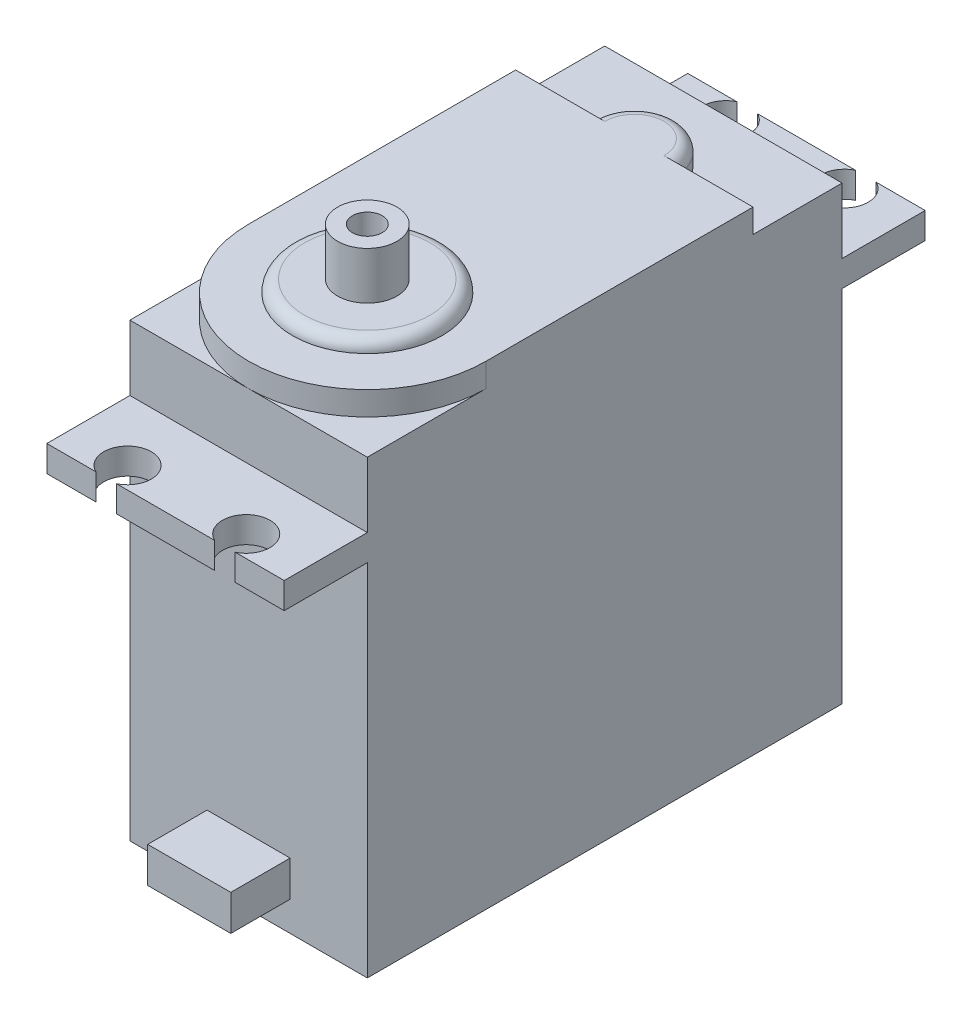
ISO-10303-21;
HEADER;
FILE_DESCRIPTION(('STEP AP214'),'2;1');
FILE_NAME('part.step','',(''),(''),'','','');
FILE_SCHEMA(('AUTOMOTIVE_DESIGN { 1 0 10303 214 1 1 1 1 }'));
ENDSEC;
DATA;
#1=APPLICATION_CONTEXT('core data for automotive mechanical design processes');
#2=APPLICATION_PROTOCOL_DEFINITION('international standard','automotive_design',2000,#1);
#3=PRODUCT_CONTEXT('',#1,'mechanical');
#4=PRODUCT('Part','Part','',(#3));
#5=PRODUCT_RELATED_PRODUCT_CATEGORY('part','',(#4));
#6=PRODUCT_DEFINITION_FORMATION('','',#4);
#7=PRODUCT_DEFINITION_CONTEXT('part definition',#1,'design');
#8=PRODUCT_DEFINITION('design','',#6,#7);
#9=PRODUCT_DEFINITION_SHAPE('','',#8);
#10=(LENGTH_UNIT() NAMED_UNIT(*) SI_UNIT(.MILLI.,.METRE.));
#11=(NAMED_UNIT(*) PLANE_ANGLE_UNIT() SI_UNIT($,.RADIAN.));
#12=(NAMED_UNIT(*) SI_UNIT($,.STERADIAN.) SOLID_ANGLE_UNIT());
#13=UNCERTAINTY_MEASURE_WITH_UNIT(LENGTH_MEASURE(1.E-05),#10,'distance_accuracy_value','');
#14=(GEOMETRIC_REPRESENTATION_CONTEXT(3) GLOBAL_UNCERTAINTY_ASSIGNED_CONTEXT((#13)) GLOBAL_UNIT_ASSIGNED_CONTEXT((#10,
#11,#12)) REPRESENTATION_CONTEXT('',''));
#15=CARTESIAN_POINT('',(0.,0.,0.));
#16=DIRECTION('',(0.,0.,1.));
#17=DIRECTION('',(1.,0.,0.));
#18=AXIS2_PLACEMENT_3D('',#15,#16,#17);
#19=CARTESIAN_POINT('',(0.,38.,0.));
#20=DIRECTION('',(0.,-1.,0.));
#21=DIRECTION('',(0.,0.,-1.));
#22=AXIS2_PLACEMENT_3D('',#19,#20,#21);
#23=PLANE('',#22);
#24=DIRECTION('',(-1.,0.,0.));
#25=VECTOR('',#24,1.);
#26=CARTESIAN_POINT('',(20.,38.,-32.5));
#27=LINE('',#26,#25);
#28=CARTESIAN_POINT('',(20.,38.,-32.5));
#29=VERTEX_POINT('',#28);
#30=CARTESIAN_POINT('',(13.5,38.,-32.5));
#31=VERTEX_POINT('',#30);
#32=EDGE_CURVE('E514',#29,#31,#27,.T.);
#33=ORIENTED_EDGE('',*,*,#32,.F.);
#34=DIRECTION('',(0.,0.,-1.));
#35=VECTOR('',#34,1.);
#36=CARTESIAN_POINT('',(20.,38.,0.));
#37=LINE('',#36,#35);
#38=CARTESIAN_POINT('',(20.,38.,-40.));
#39=VERTEX_POINT('',#38);
#40=EDGE_CURVE('E274',#29,#39,#37,.T.);
#41=ORIENTED_EDGE('',*,*,#40,.T.);
#42=DIRECTION('',(-1.,0.,0.));
#43=VECTOR('',#42,1.);
#44=CARTESIAN_POINT('',(0.,38.,-40.));
#45=LINE('',#44,#43);
#46=CARTESIAN_POINT('',(0.,38.,-40.));
#47=VERTEX_POINT('',#46);
#48=EDGE_CURVE('E445',#39,#47,#45,.T.);
#49=ORIENTED_EDGE('',*,*,#48,.T.);
#50=DIRECTION('',(0.,0.,1.));
#51=VECTOR('',#50,1.);
#52=CARTESIAN_POINT('',(0.,38.,0.));
#53=LINE('',#52,#51);
#54=CARTESIAN_POINT('',(0.,38.,-32.5));
#55=VERTEX_POINT('',#54);
#56=EDGE_CURVE('E433',#47,#55,#53,.T.);
#57=ORIENTED_EDGE('',*,*,#56,.T.);
#58=DIRECTION('',(-1.,0.,0.));
#59=VECTOR('',#58,1.);
#60=CARTESIAN_POINT('',(6.5,38.,-32.5));
#61=LINE('',#60,#59);
#62=CARTESIAN_POINT('',(6.5,38.,-32.5));
#63=VERTEX_POINT('',#62);
#64=EDGE_CURVE('E637',#63,#55,#61,.T.);
#65=ORIENTED_EDGE('',*,*,#64,.F.);
#66=CARTESIAN_POINT('',(10.,38.,-32.5));
#67=DIRECTION('',(0.,1.,0.));
#68=DIRECTION('',(0.,0.,1.));
#69=AXIS2_PLACEMENT_3D('',#66,#67,#68);
#70=CIRCLE('',#69,3.5);
#71=EDGE_CURVE('E660',#31,#63,#70,.T.);
#72=ORIENTED_EDGE('',*,*,#71,.F.);
#73=EDGE_LOOP('',(#33,#41,#49,#57,#65,#72));
#74=FACE_BOUND('',#73,.T.);
#75=ADVANCED_FACE('F41',(#74),#23,.F.);
#76=CARTESIAN_POINT('',(10.,38.,-10.));
#77=DIRECTION('',(0.,1.,0.));
#78=DIRECTION('',(0.,0.,1.));
#79=AXIS2_PLACEMENT_3D('',#76,#77,#78);
#80=CIRCLE('',#79,10.);
#81=CARTESIAN_POINT('',(0.,38.,-10.));
#82=VERTEX_POINT('',#81);
#83=CARTESIAN_POINT('',(10.,38.,0.));
#84=VERTEX_POINT('',#83);
#85=EDGE_CURVE('E268',#82,#84,#80,.T.);
#86=ORIENTED_EDGE('',*,*,#85,.F.);
#87=CARTESIAN_POINT('',(0.,38.,0.));
#88=VERTEX_POINT('',#87);
#89=EDGE_CURVE('E437',#82,#88,#53,.T.);
#90=ORIENTED_EDGE('',*,*,#89,.T.);
#91=DIRECTION('',(1.,0.,0.));
#92=VECTOR('',#91,1.);
#93=CARTESIAN_POINT('',(0.,38.,0.));
#94=LINE('',#93,#92);
#95=EDGE_CURVE('E438',#88,#84,#94,.T.);
#96=ORIENTED_EDGE('',*,*,#95,.T.);
#97=EDGE_LOOP('',(#86,#90,#96));
#98=FACE_BOUND('',#97,.T.);
#99=ADVANCED_FACE('F608',(#98),#23,.F.);
#100=CARTESIAN_POINT('',(0.,0.,-47.));
#101=DIRECTION('',(0.,0.,1.));
#102=DIRECTION('',(1.,0.,0.));
#103=AXIS2_PLACEMENT_3D('',#100,#101,#102);
#104=PLANE('',#103);
#105=DIRECTION('',(1.,0.,0.));
#106=VECTOR('',#105,1.);
#107=CARTESIAN_POINT('',(0.,30.3,-47.));
#108=LINE('',#107,#106);
#109=CARTESIAN_POINT('',(5.87177978870814,30.3,-47.));
#110=VERTEX_POINT('',#109);
#111=CARTESIAN_POINT('',(14.1282202112918,30.3,-47.));
#112=VERTEX_POINT('',#111);
#113=EDGE_CURVE('E347',#110,#112,#108,.T.);
#114=ORIENTED_EDGE('',*,*,#113,.F.);
#115=DIRECTION('',(0.,1.,0.));
#116=VECTOR('',#115,1.);
#117=CARTESIAN_POINT('',(5.87177978870814,25.5,-47.));
#118=LINE('',#117,#116);
#119=CARTESIAN_POINT('',(5.87177978870814,32.5,-47.));
#120=VERTEX_POINT('',#119);
#121=EDGE_CURVE('E313',#110,#120,#118,.T.);
#122=ORIENTED_EDGE('',*,*,#121,.T.);
#123=DIRECTION('',(-1.,0.,0.));
#124=VECTOR('',#123,1.);
#125=CARTESIAN_POINT('',(0.,32.5,-47.));
#126=LINE('',#125,#124);
#127=CARTESIAN_POINT('',(14.1282202112918,32.5,-47.));
#128=VERTEX_POINT('',#127);
#129=EDGE_CURVE('E357',#128,#120,#126,.T.);
#130=ORIENTED_EDGE('',*,*,#129,.F.);
#131=DIRECTION('',(0.,1.,0.));
#132=VECTOR('',#131,1.);
#133=CARTESIAN_POINT('',(14.1282202112918,25.5,-47.));
#134=LINE('',#133,#132);
#135=EDGE_CURVE('E298',#128,#112,#134,.F.);
#136=ORIENTED_EDGE('',*,*,#135,.T.);
#137=EDGE_LOOP('',(#114,#122,#130,#136));
#138=FACE_BOUND('',#137,.T.);
#139=ADVANCED_FACE('F615',(#138),#104,.F.);
#140=CARTESIAN_POINT('',(15.8717797887081,30.3,-47.));
#141=VERTEX_POINT('',#140);
#142=CARTESIAN_POINT('',(20.,30.3,-47.));
#143=VERTEX_POINT('',#142);
#144=EDGE_CURVE('E341',#141,#143,#108,.T.);
#145=ORIENTED_EDGE('',*,*,#144,.F.);
#146=DIRECTION('',(0.,1.,0.));
#147=VECTOR('',#146,1.);
#148=CARTESIAN_POINT('',(15.8717797887081,25.5,-47.));
#149=LINE('',#148,#147);
#150=CARTESIAN_POINT('',(15.8717797887081,32.5,-47.));
#151=VERTEX_POINT('',#150);
#152=EDGE_CURVE('E302',#141,#151,#149,.T.);
#153=ORIENTED_EDGE('',*,*,#152,.T.);
#154=CARTESIAN_POINT('',(20.,32.5,-47.));
#155=VERTEX_POINT('',#154);
#156=EDGE_CURVE('E352',#155,#151,#126,.T.);
#157=ORIENTED_EDGE('',*,*,#156,.F.);
#158=DIRECTION('',(0.,1.,0.));
#159=VECTOR('',#158,1.);
#160=CARTESIAN_POINT('',(20.,32.5,-47.));
#161=LINE('',#160,#159);
#162=EDGE_CURVE('E346',#143,#155,#161,.T.);
#163=ORIENTED_EDGE('',*,*,#162,.F.);
#164=EDGE_LOOP('',(#145,#153,#157,#163));
#165=FACE_BOUND('',#164,.T.);
#166=ADVANCED_FACE('F760',(#165),#104,.F.);
#167=CARTESIAN_POINT('',(0.,0.,7.));
#168=DIRECTION('',(0.,0.,1.));
#169=DIRECTION('',(1.,0.,0.));
#170=AXIS2_PLACEMENT_3D('',#167,#168,#169);
#171=PLANE('',#170);
#172=DIRECTION('',(0.,1.,0.));
#173=VECTOR('',#172,1.);
#174=CARTESIAN_POINT('',(15.8717797887082,25.5,7.));
#175=LINE('',#174,#173);
#176=CARTESIAN_POINT('',(15.8717797887082,30.3,7.));
#177=VERTEX_POINT('',#176);
#178=CARTESIAN_POINT('',(15.8717797887082,32.5,7.));
#179=VERTEX_POINT('',#178);
#180=EDGE_CURVE('E500',#177,#179,#175,.T.);
#181=ORIENTED_EDGE('',*,*,#180,.F.);
#182=DIRECTION('',(1.,0.,0.));
#183=VECTOR('',#182,1.);
#184=CARTESIAN_POINT('',(0.,30.3,7.));
#185=LINE('',#184,#183);
#186=CARTESIAN_POINT('',(20.,30.3,7.));
#187=VERTEX_POINT('',#186);
#188=EDGE_CURVE('E321',#177,#187,#185,.T.);
#189=ORIENTED_EDGE('',*,*,#188,.T.);
#190=DIRECTION('',(0.,1.,0.));
#191=VECTOR('',#190,1.);
#192=CARTESIAN_POINT('',(20.,32.5,7.));
#193=LINE('',#192,#191);
#194=CARTESIAN_POINT('',(20.,32.5,7.));
#195=VERTEX_POINT('',#194);
#196=EDGE_CURVE('E326',#187,#195,#193,.T.);
#197=ORIENTED_EDGE('',*,*,#196,.T.);
#198=DIRECTION('',(-1.,0.,0.));
#199=VECTOR('',#198,1.);
#200=CARTESIAN_POINT('',(0.,32.5,7.));
#201=LINE('',#200,#199);
#202=EDGE_CURVE('E332',#195,#179,#201,.T.);
#203=ORIENTED_EDGE('',*,*,#202,.T.);
#204=EDGE_LOOP('',(#181,#189,#197,#203));
#205=FACE_BOUND('',#204,.T.);
#206=ADVANCED_FACE('F552',(#205),#171,.T.);
#207=DIRECTION('',(0.,1.,0.));
#208=VECTOR('',#207,1.);
#209=CARTESIAN_POINT('',(14.1282202112919,25.5,7.));
#210=LINE('',#209,#208);
#211=CARTESIAN_POINT('',(14.1282202112919,32.5,7.));
#212=VERTEX_POINT('',#211);
#213=CARTESIAN_POINT('',(14.1282202112919,30.3,7.));
#214=VERTEX_POINT('',#213);
#215=EDGE_CURVE('E497',#212,#214,#210,.F.);
#216=ORIENTED_EDGE('',*,*,#215,.F.);
#217=CARTESIAN_POINT('',(5.87177978870814,32.5,7.));
#218=VERTEX_POINT('',#217);
#219=EDGE_CURVE('E337',#212,#218,#201,.T.);
#220=ORIENTED_EDGE('',*,*,#219,.T.);
#221=DIRECTION('',(0.,1.,0.));
#222=VECTOR('',#221,1.);
#223=CARTESIAN_POINT('',(5.87177978870814,25.5,7.));
#224=LINE('',#223,#222);
#225=CARTESIAN_POINT('',(5.87177978870814,30.3,7.));
#226=VERTEX_POINT('',#225);
#227=EDGE_CURVE('E494',#226,#218,#224,.T.);
#228=ORIENTED_EDGE('',*,*,#227,.F.);
#229=EDGE_CURVE('E327',#226,#214,#185,.T.);
#230=ORIENTED_EDGE('',*,*,#229,.T.);
#231=EDGE_LOOP('',(#216,#220,#228,#230));
#232=FACE_BOUND('',#231,.T.);
#233=ADVANCED_FACE('F592',(#232),#171,.T.);
#234=CARTESIAN_POINT('',(0.,38.,0.));
#235=DIRECTION('',(0.,0.,-1.));
#236=DIRECTION('',(-1.,0.,0.));
#237=AXIS2_PLACEMENT_3D('',#234,#235,#236);
#238=PLANE('',#237);
#239=DIRECTION('',(0.,-1.,0.));
#240=VECTOR('',#239,1.);
#241=CARTESIAN_POINT('',(0.,38.,0.));
#242=LINE('',#241,#240);
#243=CARTESIAN_POINT('',(0.,32.5,0.));
#244=VERTEX_POINT('',#243);
#245=EDGE_CURVE('E479',#88,#244,#242,.T.);
#246=ORIENTED_EDGE('',*,*,#245,.T.);
#247=DIRECTION('',(1.,0.,0.));
#248=VECTOR('',#247,1.);
#249=CARTESIAN_POINT('',(0.,32.5,0.));
#250=LINE('',#249,#248);
#251=CARTESIAN_POINT('',(20.,32.5,0.));
#252=VERTEX_POINT('',#251);
#253=EDGE_CURVE('E379',#244,#252,#250,.T.);
#254=ORIENTED_EDGE('',*,*,#253,.T.);
#255=DIRECTION('',(0.,-1.,0.));
#256=VECTOR('',#255,1.);
#257=CARTESIAN_POINT('',(20.,38.,0.));
#258=LINE('',#257,#256);
#259=CARTESIAN_POINT('',(20.,38.,0.));
#260=VERTEX_POINT('',#259);
#261=EDGE_CURVE('E474',#260,#252,#258,.T.);
#262=ORIENTED_EDGE('',*,*,#261,.F.);
#263=EDGE_CURVE('E436',#84,#260,#94,.T.);
#264=ORIENTED_EDGE('',*,*,#263,.F.);
#265=ORIENTED_EDGE('',*,*,#95,.F.);
#266=EDGE_LOOP('',(#246,#254,#262,#264,#265));
#267=FACE_BOUND('',#266,.T.);
#268=ADVANCED_FACE('F567',(#267),#238,.F.);
#269=CARTESIAN_POINT('',(0.,38.,-40.));
#270=DIRECTION('',(0.,0.,1.));
#271=DIRECTION('',(1.,0.,0.));
#272=AXIS2_PLACEMENT_3D('',#269,#270,#271);
#273=PLANE('',#272);
#274=DIRECTION('',(0.,-1.,0.));
#275=VECTOR('',#274,1.);
#276=CARTESIAN_POINT('',(20.,38.,-40.));
#277=LINE('',#276,#275);
#278=CARTESIAN_POINT('',(20.,32.5,-40.));
#279=VERTEX_POINT('',#278);
#280=EDGE_CURVE('E469',#39,#279,#277,.T.);
#281=ORIENTED_EDGE('',*,*,#280,.T.);
#282=DIRECTION('',(-1.,0.,0.));
#283=VECTOR('',#282,1.);
#284=CARTESIAN_POINT('',(0.,32.5,-40.));
#285=LINE('',#284,#283);
#286=CARTESIAN_POINT('',(0.,32.5,-40.));
#287=VERTEX_POINT('',#286);
#288=EDGE_CURVE('E487',#279,#287,#285,.T.);
#289=ORIENTED_EDGE('',*,*,#288,.T.);
#290=DIRECTION('',(0.,-1.,0.));
#291=VECTOR('',#290,1.);
#292=CARTESIAN_POINT('',(0.,38.,-40.));
#293=LINE('',#292,#291);
#294=EDGE_CURVE('E464',#47,#287,#293,.T.);
#295=ORIENTED_EDGE('',*,*,#294,.F.);
#296=ORIENTED_EDGE('',*,*,#48,.F.);
#297=EDGE_LOOP('',(#281,#289,#295,#296));
#298=FACE_BOUND('',#297,.T.);
#299=ADVANCED_FACE('F631',(#298),#273,.F.);
#300=CARTESIAN_POINT('',(20.,30.3,0.));
#301=VERTEX_POINT('',#300);
#302=CARTESIAN_POINT('',(20.,0.,0.));
#303=VERTEX_POINT('',#302);
#304=EDGE_CURVE('E473',#301,#303,#258,.T.);
#305=ORIENTED_EDGE('',*,*,#304,.F.);
#306=DIRECTION('',(-1.,0.,0.));
#307=VECTOR('',#306,1.);
#308=CARTESIAN_POINT('',(0.,30.3,0.));
#309=LINE('',#308,#307);
#310=CARTESIAN_POINT('',(0.,30.3,0.));
#311=VERTEX_POINT('',#310);
#312=EDGE_CURVE('E361',#301,#311,#309,.T.);
#313=ORIENTED_EDGE('',*,*,#312,.T.);
#314=CARTESIAN_POINT('',(0.,0.,0.));
#315=VERTEX_POINT('',#314);
#316=EDGE_CURVE('E478',#311,#315,#242,.T.);
#317=ORIENTED_EDGE('',*,*,#316,.T.);
#318=DIRECTION('',(1.,0.,0.));
#319=VECTOR('',#318,1.);
#320=CARTESIAN_POINT('',(0.,0.,0.));
#321=LINE('',#320,#319);
#322=EDGE_CURVE('E452',#315,#303,#321,.T.);
#323=ORIENTED_EDGE('',*,*,#322,.T.);
#324=EDGE_LOOP('',(#305,#313,#317,#323));
#325=FACE_BOUND('',#324,.T.);
#326=DIRECTION('',(0.,-1.,0.));
#327=VECTOR('',#326,1.);
#328=CARTESIAN_POINT('',(6.5,2.5,0.));
#329=LINE('',#328,#327);
#330=CARTESIAN_POINT('',(6.5,5.5,0.));
#331=VERTEX_POINT('',#330);
#332=CARTESIAN_POINT('',(6.5,2.5,0.));
#333=VERTEX_POINT('',#332);
#334=EDGE_CURVE('E387',#331,#333,#329,.T.);
#335=ORIENTED_EDGE('',*,*,#334,.F.);
#336=DIRECTION('',(-1.,0.,0.));
#337=VECTOR('',#336,1.);
#338=CARTESIAN_POINT('',(6.5,5.5,0.));
#339=LINE('',#338,#337);
#340=CARTESIAN_POINT('',(13.5,5.5,0.));
#341=VERTEX_POINT('',#340);
#342=EDGE_CURVE('E393',#341,#331,#339,.T.);
#343=ORIENTED_EDGE('',*,*,#342,.F.);
#344=DIRECTION('',(0.,1.,0.));
#345=VECTOR('',#344,1.);
#346=CARTESIAN_POINT('',(13.5,2.5,0.));
#347=LINE('',#346,#345);
#348=CARTESIAN_POINT('',(13.5,2.5,0.));
#349=VERTEX_POINT('',#348);
#350=EDGE_CURVE('E410',#349,#341,#347,.T.);
#351=ORIENTED_EDGE('',*,*,#350,.F.);
#352=DIRECTION('',(1.,0.,0.));
#353=VECTOR('',#352,1.);
#354=CARTESIAN_POINT('',(6.5,2.5,0.));
#355=LINE('',#354,#353);
#356=EDGE_CURVE('E406',#333,#349,#355,.T.);
#357=ORIENTED_EDGE('',*,*,#356,.F.);
#358=EDGE_LOOP('',(#335,#343,#351,#357));
#359=FACE_BOUND('',#358,.T.);
#360=ADVANCED_FACE('F737',(#325,#359),#238,.F.);
#361=CARTESIAN_POINT('',(0.,38.,0.));
#362=DIRECTION('',(1.,0.,0.));
#363=DIRECTION('',(0.,0.,-1.));
#364=AXIS2_PLACEMENT_3D('',#361,#362,#363);
#365=PLANE('',#364);
#366=ORIENTED_EDGE('',*,*,#316,.F.);
#367=DIRECTION('',(0.,0.,1.));
#368=VECTOR('',#367,1.);
#369=CARTESIAN_POINT('',(0.,30.3,-47.));
#370=LINE('',#369,#368);
#371=CARTESIAN_POINT('',(0.,30.3,7.));
#372=VERTEX_POINT('',#371);
#373=EDGE_CURVE('E356',#311,#372,#370,.T.);
#374=ORIENTED_EDGE('',*,*,#373,.T.);
#375=DIRECTION('',(0.,-1.,0.));
#376=VECTOR('',#375,1.);
#377=CARTESIAN_POINT('',(0.,32.5,7.));
#378=LINE('',#377,#376);
#379=CARTESIAN_POINT('',(0.,32.5,7.));
#380=VERTEX_POINT('',#379);
#381=EDGE_CURVE('E317',#380,#372,#378,.T.);
#382=ORIENTED_EDGE('',*,*,#381,.F.);
#383=DIRECTION('',(0.,0.,1.));
#384=VECTOR('',#383,1.);
#385=CARTESIAN_POINT('',(0.,32.5,-47.));
#386=LINE('',#385,#384);
#387=EDGE_CURVE('E362',#244,#380,#386,.T.);
#388=ORIENTED_EDGE('',*,*,#387,.F.);
#389=ORIENTED_EDGE('',*,*,#245,.F.);
#390=ORIENTED_EDGE('',*,*,#89,.F.);
#391=DIRECTION('',(0.,-1.,0.));
#392=VECTOR('',#391,1.);
#393=CARTESIAN_POINT('',(0.,40.,-10.));
#394=LINE('',#393,#392);
#395=CARTESIAN_POINT('',(0.,40.,-10.));
#396=VERTEX_POINT('',#395);
#397=EDGE_CURVE('E640',#396,#82,#394,.T.);
#398=ORIENTED_EDGE('',*,*,#397,.F.);
#399=DIRECTION('',(0.,0.,1.));
#400=VECTOR('',#399,1.);
#401=CARTESIAN_POINT('',(0.,40.,-32.5));
#402=LINE('',#401,#400);
#403=CARTESIAN_POINT('',(0.,40.,-32.5));
#404=VERTEX_POINT('',#403);
#405=EDGE_CURVE('E670',#404,#396,#402,.T.);
#406=ORIENTED_EDGE('',*,*,#405,.F.);
#407=DIRECTION('',(0.,-1.,0.));
#408=VECTOR('',#407,1.);
#409=CARTESIAN_POINT('',(0.,40.,-32.5));
#410=LINE('',#409,#408);
#411=EDGE_CURVE('E650',#404,#55,#410,.T.);
#412=ORIENTED_EDGE('',*,*,#411,.T.);
#413=ORIENTED_EDGE('',*,*,#56,.F.);
#414=ORIENTED_EDGE('',*,*,#294,.T.);
#415=CARTESIAN_POINT('',(0.,32.5,-47.));
#416=VERTEX_POINT('',#415);
#417=EDGE_CURVE('E358',#416,#287,#386,.T.);
#418=ORIENTED_EDGE('',*,*,#417,.F.);
#419=DIRECTION('',(0.,-1.,0.));
#420=VECTOR('',#419,1.);
#421=CARTESIAN_POINT('',(0.,32.5,-47.));
#422=LINE('',#421,#420);
#423=CARTESIAN_POINT('',(0.,30.3,-47.));
#424=VERTEX_POINT('',#423);
#425=EDGE_CURVE('E336',#416,#424,#422,.T.);
#426=ORIENTED_EDGE('',*,*,#425,.T.);
#427=CARTESIAN_POINT('',(0.,30.3,-40.));
#428=VERTEX_POINT('',#427);
#429=EDGE_CURVE('E372',#424,#428,#370,.T.);
#430=ORIENTED_EDGE('',*,*,#429,.T.);
#431=CARTESIAN_POINT('',(0.,0.,-40.));
#432=VERTEX_POINT('',#431);
#433=EDGE_CURVE('E448',#428,#432,#293,.T.);
#434=ORIENTED_EDGE('',*,*,#433,.T.);
#435=DIRECTION('',(0.,0.,1.));
#436=VECTOR('',#435,1.);
#437=CARTESIAN_POINT('',(0.,0.,0.));
#438=LINE('',#437,#436);
#439=EDGE_CURVE('E432',#432,#315,#438,.T.);
#440=ORIENTED_EDGE('',*,*,#439,.T.);
#441=EDGE_LOOP('',(#366,#374,#382,#388,#389,#390,#398,#406,#412,#413,#414,#418,#426,#430,#434,#440));
#442=FACE_BOUND('',#441,.T.);
#443=ADVANCED_FACE('F574',(#442),#365,.F.);
#444=CARTESIAN_POINT('',(20.,38.,0.));
#445=DIRECTION('',(-1.,0.,0.));
#446=DIRECTION('',(0.,0.,1.));
#447=AXIS2_PLACEMENT_3D('',#444,#445,#446);
#448=PLANE('',#447);
#449=CARTESIAN_POINT('',(20.,30.3,-40.));
#450=VERTEX_POINT('',#449);
#451=CARTESIAN_POINT('',(20.,0.,-40.));
#452=VERTEX_POINT('',#451);
#453=EDGE_CURVE('E468',#450,#452,#277,.T.);
#454=ORIENTED_EDGE('',*,*,#453,.F.);
#455=DIRECTION('',(0.,0.,1.));
#456=VECTOR('',#455,1.);
#457=CARTESIAN_POINT('',(20.,30.3,-47.));
#458=LINE('',#457,#456);
#459=EDGE_CURVE('E368',#143,#450,#458,.T.);
#460=ORIENTED_EDGE('',*,*,#459,.F.);
#461=ORIENTED_EDGE('',*,*,#162,.T.);
#462=DIRECTION('',(0.,0.,1.));
#463=VECTOR('',#462,1.);
#464=CARTESIAN_POINT('',(20.,32.5,-47.));
#465=LINE('',#464,#463);
#466=EDGE_CURVE('E363',#155,#279,#465,.T.);
#467=ORIENTED_EDGE('',*,*,#466,.T.);
#468=ORIENTED_EDGE('',*,*,#280,.F.);
#469=ORIENTED_EDGE('',*,*,#40,.F.);
#470=DIRECTION('',(0.,-1.,0.));
#471=VECTOR('',#470,1.);
#472=CARTESIAN_POINT('',(20.,40.,-32.5));
#473=LINE('',#472,#471);
#474=CARTESIAN_POINT('',(20.,40.,-32.5));
#475=VERTEX_POINT('',#474);
#476=EDGE_CURVE('E251',#475,#29,#473,.T.);
#477=ORIENTED_EDGE('',*,*,#476,.F.);
#478=DIRECTION('',(0.,0.,-1.));
#479=VECTOR('',#478,1.);
#480=CARTESIAN_POINT('',(20.,40.,-32.5));
#481=LINE('',#480,#479);
#482=CARTESIAN_POINT('',(20.,40.,-10.));
#483=VERTEX_POINT('',#482);
#484=EDGE_CURVE('E258',#483,#475,#481,.T.);
#485=ORIENTED_EDGE('',*,*,#484,.F.);
#486=DIRECTION('',(0.,-1.,0.));
#487=VECTOR('',#486,1.);
#488=CARTESIAN_POINT('',(20.,40.,-10.));
#489=LINE('',#488,#487);
#490=CARTESIAN_POINT('',(20.,38.,-10.));
#491=VERTEX_POINT('',#490);
#492=EDGE_CURVE('E645',#483,#491,#489,.T.);
#493=ORIENTED_EDGE('',*,*,#492,.T.);
#494=EDGE_CURVE('E442',#260,#491,#37,.T.);
#495=ORIENTED_EDGE('',*,*,#494,.F.);
#496=ORIENTED_EDGE('',*,*,#261,.T.);
#497=EDGE_CURVE('E367',#252,#195,#465,.T.);
#498=ORIENTED_EDGE('',*,*,#497,.T.);
#499=ORIENTED_EDGE('',*,*,#196,.F.);
#500=EDGE_CURVE('E371',#301,#187,#458,.T.);
#501=ORIENTED_EDGE('',*,*,#500,.F.);
#502=ORIENTED_EDGE('',*,*,#304,.T.);
#503=DIRECTION('',(0.,0.,-1.));
#504=VECTOR('',#503,1.);
#505=CARTESIAN_POINT('',(20.,0.,0.));
#506=LINE('',#505,#504);
#507=EDGE_CURVE('E456',#303,#452,#506,.T.);
#508=ORIENTED_EDGE('',*,*,#507,.T.);
#509=EDGE_LOOP('',(#454,#460,#461,#467,#468,#469,#477,#485,#493,#495,#496,#498,#499,#501,#502,#508));
#510=FACE_BOUND('',#509,.T.);
#511=ADVANCED_FACE('F272',(#510),#448,.F.);
#512=ORIENTED_EDGE('',*,*,#433,.F.);
#513=DIRECTION('',(1.,0.,0.));
#514=VECTOR('',#513,1.);
#515=CARTESIAN_POINT('',(0.,30.3,-40.));
#516=LINE('',#515,#514);
#517=EDGE_CURVE('E483',#428,#450,#516,.T.);
#518=ORIENTED_EDGE('',*,*,#517,.T.);
#519=ORIENTED_EDGE('',*,*,#453,.T.);
#520=DIRECTION('',(-1.,0.,0.));
#521=VECTOR('',#520,1.);
#522=CARTESIAN_POINT('',(0.,0.,-40.));
#523=LINE('',#522,#521);
#524=EDGE_CURVE('E460',#452,#432,#523,.T.);
#525=ORIENTED_EDGE('',*,*,#524,.T.);
#526=EDGE_LOOP('',(#512,#518,#519,#525));
#527=FACE_BOUND('',#526,.T.);
#528=ADVANCED_FACE('F621',(#527),#273,.F.);
#529=EDGE_CURVE('E633',#84,#491,#80,.T.);
#530=ORIENTED_EDGE('',*,*,#529,.F.);
#531=ORIENTED_EDGE('',*,*,#263,.T.);
#532=ORIENTED_EDGE('',*,*,#494,.T.);
#533=EDGE_LOOP('',(#530,#531,#532));
#534=FACE_BOUND('',#533,.T.);
#535=ADVANCED_FACE('F611',(#534),#23,.F.);
#536=CARTESIAN_POINT('',(0.,0.,0.));
#537=DIRECTION('',(0.,-1.,0.));
#538=DIRECTION('',(0.,0.,-1.));
#539=AXIS2_PLACEMENT_3D('',#536,#537,#538);
#540=PLANE('',#539);
#541=ORIENTED_EDGE('',*,*,#439,.F.);
#542=ORIENTED_EDGE('',*,*,#524,.F.);
#543=ORIENTED_EDGE('',*,*,#507,.F.);
#544=ORIENTED_EDGE('',*,*,#322,.F.);
#545=EDGE_LOOP('',(#541,#542,#543,#544));
#546=FACE_BOUND('',#545,.T.);
#547=ADVANCED_FACE('F620',(#546),#540,.T.);
#548=CARTESIAN_POINT('',(6.5,2.5,5.));
#549=DIRECTION('',(1.,0.,0.));
#550=DIRECTION('',(0.,0.,-1.));
#551=AXIS2_PLACEMENT_3D('',#548,#549,#550);
#552=PLANE('',#551);
#553=ORIENTED_EDGE('',*,*,#334,.T.);
#554=DIRECTION('',(0.,0.,-1.));
#555=VECTOR('',#554,1.);
#556=CARTESIAN_POINT('',(6.5,2.5,5.));
#557=LINE('',#556,#555);
#558=CARTESIAN_POINT('',(6.5,2.5,5.));
#559=VERTEX_POINT('',#558);
#560=EDGE_CURVE('E428',#559,#333,#557,.T.);
#561=ORIENTED_EDGE('',*,*,#560,.F.);
#562=DIRECTION('',(0.,-1.,0.));
#563=VECTOR('',#562,1.);
#564=CARTESIAN_POINT('',(6.5,2.5,5.));
#565=LINE('',#564,#563);
#566=CARTESIAN_POINT('',(6.5,5.5,5.));
#567=VERTEX_POINT('',#566);
#568=EDGE_CURVE('E388',#567,#559,#565,.T.);
#569=ORIENTED_EDGE('',*,*,#568,.F.);
#570=DIRECTION('',(0.,0.,-1.));
#571=VECTOR('',#570,1.);
#572=CARTESIAN_POINT('',(6.5,5.5,5.));
#573=LINE('',#572,#571);
#574=EDGE_CURVE('E402',#567,#331,#573,.T.);
#575=ORIENTED_EDGE('',*,*,#574,.T.);
#576=EDGE_LOOP('',(#553,#561,#569,#575));
#577=FACE_BOUND('',#576,.T.);
#578=ADVANCED_FACE('F627',(#577),#552,.F.);
#579=CARTESIAN_POINT('',(6.5,2.5,5.));
#580=DIRECTION('',(0.,1.,0.));
#581=DIRECTION('',(0.,0.,1.));
#582=AXIS2_PLACEMENT_3D('',#579,#580,#581);
#583=PLANE('',#582);
#584=ORIENTED_EDGE('',*,*,#356,.T.);
#585=DIRECTION('',(0.,0.,-1.));
#586=VECTOR('',#585,1.);
#587=CARTESIAN_POINT('',(13.5,2.5,5.));
#588=LINE('',#587,#586);
#589=CARTESIAN_POINT('',(13.5,2.5,5.));
#590=VERTEX_POINT('',#589);
#591=EDGE_CURVE('E424',#590,#349,#588,.T.);
#592=ORIENTED_EDGE('',*,*,#591,.F.);
#593=DIRECTION('',(1.,0.,0.));
#594=VECTOR('',#593,1.);
#595=CARTESIAN_POINT('',(6.5,2.5,5.));
#596=LINE('',#595,#594);
#597=EDGE_CURVE('E392',#559,#590,#596,.T.);
#598=ORIENTED_EDGE('',*,*,#597,.F.);
#599=ORIENTED_EDGE('',*,*,#560,.T.);
#600=EDGE_LOOP('',(#584,#592,#598,#599));
#601=FACE_BOUND('',#600,.T.);
#602=ADVANCED_FACE('F725',(#601),#583,.F.);
#603=CARTESIAN_POINT('',(13.5,2.5,5.));
#604=DIRECTION('',(-1.,0.,0.));
#605=DIRECTION('',(0.,0.,1.));
#606=AXIS2_PLACEMENT_3D('',#603,#604,#605);
#607=PLANE('',#606);
#608=ORIENTED_EDGE('',*,*,#350,.T.);
#609=DIRECTION('',(0.,0.,-1.));
#610=VECTOR('',#609,1.);
#611=CARTESIAN_POINT('',(13.5,5.5,5.));
#612=LINE('',#611,#610);
#613=CARTESIAN_POINT('',(13.5,5.5,5.));
#614=VERTEX_POINT('',#613);
#615=EDGE_CURVE('E420',#614,#341,#612,.T.);
#616=ORIENTED_EDGE('',*,*,#615,.F.);
#617=DIRECTION('',(0.,1.,0.));
#618=VECTOR('',#617,1.);
#619=CARTESIAN_POINT('',(13.5,2.5,5.));
#620=LINE('',#619,#618);
#621=EDGE_CURVE('E396',#590,#614,#620,.T.);
#622=ORIENTED_EDGE('',*,*,#621,.F.);
#623=ORIENTED_EDGE('',*,*,#591,.T.);
#624=EDGE_LOOP('',(#608,#616,#622,#623));
#625=FACE_BOUND('',#624,.T.);
#626=ADVANCED_FACE('F721',(#625),#607,.F.);
#627=CARTESIAN_POINT('',(6.5,5.5,5.));
#628=DIRECTION('',(0.,-1.,0.));
#629=DIRECTION('',(0.,0.,-1.));
#630=AXIS2_PLACEMENT_3D('',#627,#628,#629);
#631=PLANE('',#630);
#632=ORIENTED_EDGE('',*,*,#342,.T.);
#633=ORIENTED_EDGE('',*,*,#574,.F.);
#634=DIRECTION('',(-1.,0.,0.));
#635=VECTOR('',#634,1.);
#636=CARTESIAN_POINT('',(6.5,5.5,5.));
#637=LINE('',#636,#635);
#638=EDGE_CURVE('E399',#614,#567,#637,.T.);
#639=ORIENTED_EDGE('',*,*,#638,.F.);
#640=ORIENTED_EDGE('',*,*,#615,.T.);
#641=EDGE_LOOP('',(#632,#633,#639,#640));
#642=FACE_BOUND('',#641,.T.);
#643=ADVANCED_FACE('F717',(#642),#631,.F.);
#644=CARTESIAN_POINT('',(0.,0.,5.));
#645=DIRECTION('',(0.,0.,-1.));
#646=DIRECTION('',(-1.,0.,0.));
#647=AXIS2_PLACEMENT_3D('',#644,#645,#646);
#648=PLANE('',#647);
#649=ORIENTED_EDGE('',*,*,#568,.T.);
#650=ORIENTED_EDGE('',*,*,#597,.T.);
#651=ORIENTED_EDGE('',*,*,#621,.T.);
#652=ORIENTED_EDGE('',*,*,#638,.T.);
#653=EDGE_LOOP('',(#649,#650,#651,#652));
#654=FACE_BOUND('',#653,.T.);
#655=ADVANCED_FACE('F713',(#654),#648,.F.);
#656=CARTESIAN_POINT('',(4.12822021129186,32.5,-47.));
#657=VERTEX_POINT('',#656);
#658=EDGE_CURVE('E351',#657,#416,#126,.T.);
#659=ORIENTED_EDGE('',*,*,#658,.F.);
#660=DIRECTION('',(0.,1.,0.));
#661=VECTOR('',#660,1.);
#662=CARTESIAN_POINT('',(4.12822021129186,25.5,-47.));
#663=LINE('',#662,#661);
#664=CARTESIAN_POINT('',(4.12822021129186,30.3,-47.));
#665=VERTEX_POINT('',#664);
#666=EDGE_CURVE('E309',#657,#665,#663,.F.);
#667=ORIENTED_EDGE('',*,*,#666,.T.);
#668=EDGE_CURVE('E342',#424,#665,#108,.T.);
#669=ORIENTED_EDGE('',*,*,#668,.F.);
#670=ORIENTED_EDGE('',*,*,#425,.F.);
#671=EDGE_LOOP('',(#659,#667,#669,#670));
#672=FACE_BOUND('',#671,.T.);
#673=ADVANCED_FACE('F716',(#672),#104,.F.);
#674=CARTESIAN_POINT('',(0.,30.3,-47.));
#675=DIRECTION('',(0.,-1.,0.));
#676=DIRECTION('',(0.,0.,-1.));
#677=AXIS2_PLACEMENT_3D('',#674,#675,#676);
#678=PLANE('',#677);
#679=CARTESIAN_POINT('',(5.,30.3,-45.2));
#680=DIRECTION('',(0.,-1.,0.));
#681=DIRECTION('',(0.,0.,-1.));
#682=AXIS2_PLACEMENT_3D('',#679,#680,#681);
#683=CIRCLE('',#682,2.00000000000001);
#684=EDGE_CURVE('E306',#110,#665,#683,.T.);
#685=ORIENTED_EDGE('',*,*,#684,.F.);
#686=ORIENTED_EDGE('',*,*,#113,.T.);
#687=CARTESIAN_POINT('',(15.,30.3,-45.2));
#688=DIRECTION('',(0.,-1.,0.));
#689=DIRECTION('',(0.,0.,-1.));
#690=AXIS2_PLACEMENT_3D('',#687,#688,#689);
#691=CIRCLE('',#690,2.00000000000001);
#692=EDGE_CURVE('E295',#141,#112,#691,.T.);
#693=ORIENTED_EDGE('',*,*,#692,.F.);
#694=ORIENTED_EDGE('',*,*,#144,.T.);
#695=ORIENTED_EDGE('',*,*,#459,.T.);
#696=ORIENTED_EDGE('',*,*,#517,.F.);
#697=ORIENTED_EDGE('',*,*,#429,.F.);
#698=ORIENTED_EDGE('',*,*,#668,.T.);
#699=EDGE_LOOP('',(#685,#686,#693,#694,#695,#696,#697,#698));
#700=FACE_BOUND('',#699,.T.);
#701=ADVANCED_FACE('F766',(#700),#678,.T.);
#702=CARTESIAN_POINT('',(0.,32.5,-47.));
#703=DIRECTION('',(0.,1.,0.));
#704=DIRECTION('',(0.,0.,1.));
#705=AXIS2_PLACEMENT_3D('',#702,#703,#704);
#706=PLANE('',#705);
#707=CARTESIAN_POINT('',(5.,32.5,-45.2));
#708=DIRECTION('',(0.,1.,0.));
#709=DIRECTION('',(0.,0.,1.));
#710=AXIS2_PLACEMENT_3D('',#707,#708,#709);
#711=CIRCLE('',#710,2.00000000000001);
#712=EDGE_CURVE('E506',#657,#120,#711,.T.);
#713=ORIENTED_EDGE('',*,*,#712,.F.);
#714=ORIENTED_EDGE('',*,*,#658,.T.);
#715=ORIENTED_EDGE('',*,*,#417,.T.);
#716=ORIENTED_EDGE('',*,*,#288,.F.);
#717=ORIENTED_EDGE('',*,*,#466,.F.);
#718=ORIENTED_EDGE('',*,*,#156,.T.);
#719=CARTESIAN_POINT('',(15.,32.5,-45.2));
#720=DIRECTION('',(0.,1.,0.));
#721=DIRECTION('',(0.,0.,1.));
#722=AXIS2_PLACEMENT_3D('',#719,#720,#721);
#723=CIRCLE('',#722,2.00000000000001);
#724=EDGE_CURVE('E503',#128,#151,#723,.T.);
#725=ORIENTED_EDGE('',*,*,#724,.F.);
#726=ORIENTED_EDGE('',*,*,#129,.T.);
#727=EDGE_LOOP('',(#713,#714,#715,#716,#717,#718,#725,#726));
#728=FACE_BOUND('',#727,.T.);
#729=ADVANCED_FACE('F770',(#728),#706,.T.);
#730=CARTESIAN_POINT('',(15.,32.5,5.2));
#731=DIRECTION('',(0.,1.,0.));
#732=DIRECTION('',(0.,0.,1.));
#733=AXIS2_PLACEMENT_3D('',#730,#731,#732);
#734=CIRCLE('',#733,2.00000000000001);
#735=EDGE_CURVE('E281',#179,#212,#734,.T.);
#736=ORIENTED_EDGE('',*,*,#735,.F.);
#737=ORIENTED_EDGE('',*,*,#202,.F.);
#738=ORIENTED_EDGE('',*,*,#497,.F.);
#739=ORIENTED_EDGE('',*,*,#253,.F.);
#740=ORIENTED_EDGE('',*,*,#387,.T.);
#741=CARTESIAN_POINT('',(4.12822021129186,32.5,7.));
#742=VERTEX_POINT('',#741);
#743=EDGE_CURVE('E331',#742,#380,#201,.T.);
#744=ORIENTED_EDGE('',*,*,#743,.F.);
#745=CARTESIAN_POINT('',(5.,32.5,5.2));
#746=DIRECTION('',(0.,1.,0.));
#747=DIRECTION('',(0.,0.,1.));
#748=AXIS2_PLACEMENT_3D('',#745,#746,#747);
#749=CIRCLE('',#748,2.);
#750=EDGE_CURVE('E276',#218,#742,#749,.T.);
#751=ORIENTED_EDGE('',*,*,#750,.F.);
#752=ORIENTED_EDGE('',*,*,#219,.F.);
#753=EDGE_LOOP('',(#736,#737,#738,#739,#740,#744,#751,#752));
#754=FACE_BOUND('',#753,.T.);
#755=ADVANCED_FACE('F564',(#754),#706,.T.);
#756=CARTESIAN_POINT('',(15.,30.3,5.2));
#757=DIRECTION('',(0.,-1.,0.));
#758=DIRECTION('',(0.,0.,-1.));
#759=AXIS2_PLACEMENT_3D('',#756,#757,#758);
#760=CIRCLE('',#759,2.00000000000001);
#761=EDGE_CURVE('E292',#214,#177,#760,.T.);
#762=ORIENTED_EDGE('',*,*,#761,.F.);
#763=ORIENTED_EDGE('',*,*,#229,.F.);
#764=CARTESIAN_POINT('',(5.,30.3,5.2));
#765=DIRECTION('',(0.,-1.,0.));
#766=DIRECTION('',(0.,0.,-1.));
#767=AXIS2_PLACEMENT_3D('',#764,#765,#766);
#768=CIRCLE('',#767,2.);
#769=CARTESIAN_POINT('',(4.12822021129186,30.3,7.));
#770=VERTEX_POINT('',#769);
#771=EDGE_CURVE('E289',#770,#226,#768,.T.);
#772=ORIENTED_EDGE('',*,*,#771,.F.);
#773=EDGE_CURVE('E322',#372,#770,#185,.T.);
#774=ORIENTED_EDGE('',*,*,#773,.F.);
#775=ORIENTED_EDGE('',*,*,#373,.F.);
#776=ORIENTED_EDGE('',*,*,#312,.F.);
#777=ORIENTED_EDGE('',*,*,#500,.T.);
#778=ORIENTED_EDGE('',*,*,#188,.F.);
#779=EDGE_LOOP('',(#762,#763,#772,#774,#775,#776,#777,#778));
#780=FACE_BOUND('',#779,.T.);
#781=ADVANCED_FACE('F558',(#780),#678,.T.);
#782=DIRECTION('',(0.,1.,0.));
#783=VECTOR('',#782,1.);
#784=CARTESIAN_POINT('',(4.12822021129186,25.5,7.));
#785=LINE('',#784,#783);
#786=EDGE_CURVE('E491',#742,#770,#785,.F.);
#787=ORIENTED_EDGE('',*,*,#786,.F.);
#788=ORIENTED_EDGE('',*,*,#743,.T.);
#789=ORIENTED_EDGE('',*,*,#381,.T.);
#790=ORIENTED_EDGE('',*,*,#773,.T.);
#791=EDGE_LOOP('',(#787,#788,#789,#790));
#792=FACE_BOUND('',#791,.T.);
#793=ADVANCED_FACE('F583',(#792),#171,.T.);
#794=CARTESIAN_POINT('',(5.,25.5,5.2));
#795=DIRECTION('',(0.,1.,0.));
#796=DIRECTION('',(0.,0.,1.));
#797=AXIS2_PLACEMENT_3D('',#794,#795,#796);
#798=CYLINDRICAL_SURFACE('',#797,2.);
#799=ORIENTED_EDGE('',*,*,#227,.T.);
#800=ORIENTED_EDGE('',*,*,#750,.T.);
#801=ORIENTED_EDGE('',*,*,#786,.T.);
#802=ORIENTED_EDGE('',*,*,#771,.T.);
#803=EDGE_LOOP('',(#799,#800,#801,#802));
#804=FACE_BOUND('',#803,.T.);
#805=ADVANCED_FACE('F587',(#804),#798,.F.);
#806=CARTESIAN_POINT('',(15.,25.5,5.2));
#807=DIRECTION('',(0.,1.,0.));
#808=DIRECTION('',(0.,0.,1.));
#809=AXIS2_PLACEMENT_3D('',#806,#807,#808);
#810=CYLINDRICAL_SURFACE('',#809,2.00000000000001);
#811=ORIENTED_EDGE('',*,*,#180,.T.);
#812=ORIENTED_EDGE('',*,*,#735,.T.);
#813=ORIENTED_EDGE('',*,*,#215,.T.);
#814=ORIENTED_EDGE('',*,*,#761,.T.);
#815=EDGE_LOOP('',(#811,#812,#813,#814));
#816=FACE_BOUND('',#815,.T.);
#817=ADVANCED_FACE('F594',(#816),#810,.F.);
#818=CARTESIAN_POINT('',(15.,25.5,-45.2));
#819=DIRECTION('',(0.,1.,0.));
#820=DIRECTION('',(0.,0.,1.));
#821=AXIS2_PLACEMENT_3D('',#818,#819,#820);
#822=CYLINDRICAL_SURFACE('',#821,2.00000000000001);
#823=ORIENTED_EDGE('',*,*,#692,.T.);
#824=ORIENTED_EDGE('',*,*,#135,.F.);
#825=ORIENTED_EDGE('',*,*,#724,.T.);
#826=ORIENTED_EDGE('',*,*,#152,.F.);
#827=EDGE_LOOP('',(#823,#824,#825,#826));
#828=FACE_BOUND('',#827,.T.);
#829=ADVANCED_FACE('F596',(#828),#822,.F.);
#830=CARTESIAN_POINT('',(5.,25.5,-45.2));
#831=DIRECTION('',(0.,1.,0.));
#832=DIRECTION('',(0.,0.,1.));
#833=AXIS2_PLACEMENT_3D('',#830,#831,#832);
#834=CYLINDRICAL_SURFACE('',#833,2.00000000000001);
#835=ORIENTED_EDGE('',*,*,#684,.T.);
#836=ORIENTED_EDGE('',*,*,#666,.F.);
#837=ORIENTED_EDGE('',*,*,#712,.T.);
#838=ORIENTED_EDGE('',*,*,#121,.F.);
#839=EDGE_LOOP('',(#835,#836,#837,#838));
#840=FACE_BOUND('',#839,.T.);
#841=ADVANCED_FACE('F602',(#840),#834,.F.);
#842=CARTESIAN_POINT('',(20.,40.,-32.5));
#843=DIRECTION('',(0.,0.,1.));
#844=DIRECTION('',(1.,0.,0.));
#845=AXIS2_PLACEMENT_3D('',#842,#843,#844);
#846=PLANE('',#845);
#847=ORIENTED_EDGE('',*,*,#32,.T.);
#848=DIRECTION('',(0.,-1.,0.));
#849=VECTOR('',#848,1.);
#850=CARTESIAN_POINT('',(13.5,40.,-32.5));
#851=LINE('',#850,#849);
#852=CARTESIAN_POINT('',(13.5,39.,-32.5));
#853=VERTEX_POINT('',#852);
#854=EDGE_CURVE('E277',#853,#31,#851,.T.);
#855=ORIENTED_EDGE('',*,*,#854,.F.);
#856=CARTESIAN_POINT('',(12.5,39.,-32.5));
#857=DIRECTION('',(0.,0.,1.));
#858=DIRECTION('',(1.,0.,0.));
#859=AXIS2_PLACEMENT_3D('',#856,#857,#858);
#860=CIRCLE('',#859,1.);
#861=CARTESIAN_POINT('',(12.5,40.,-32.5));
#862=VERTEX_POINT('',#861);
#863=EDGE_CURVE('E11',#853,#862,#860,.T.);
#864=ORIENTED_EDGE('',*,*,#863,.T.);
#865=DIRECTION('',(-1.,0.,0.));
#866=VECTOR('',#865,1.);
#867=CARTESIAN_POINT('',(20.,40.,-32.5));
#868=LINE('',#867,#866);
#869=EDGE_CURVE('E246',#475,#862,#868,.T.);
#870=ORIENTED_EDGE('',*,*,#869,.F.);
#871=ORIENTED_EDGE('',*,*,#476,.T.);
#872=EDGE_LOOP('',(#847,#855,#864,#870,#871));
#873=FACE_BOUND('',#872,.T.);
#874=ADVANCED_FACE('F249',(#873),#846,.F.);
#875=CARTESIAN_POINT('',(10.,40.,-32.5));
#876=DIRECTION('',(0.,-1.,0.));
#877=DIRECTION('',(0.,0.,-1.));
#878=AXIS2_PLACEMENT_3D('',#875,#876,#877);
#879=CYLINDRICAL_SURFACE('',#878,3.5);
#880=DIRECTION('',(0.,-1.,0.));
#881=VECTOR('',#880,1.);
#882=CARTESIAN_POINT('',(6.5,40.,-32.5));
#883=LINE('',#882,#881);
#884=CARTESIAN_POINT('',(6.5,39.,-32.5));
#885=VERTEX_POINT('',#884);
#886=EDGE_CURVE('E283',#885,#63,#883,.T.);
#887=ORIENTED_EDGE('',*,*,#886,.F.);
#888=CARTESIAN_POINT('',(10.,39.,-32.5));
#889=DIRECTION('',(0.,1.,0.));
#890=DIRECTION('',(0.,0.,1.));
#891=AXIS2_PLACEMENT_3D('',#888,#889,#890);
#892=CIRCLE('',#891,3.5);
#893=EDGE_CURVE('E57',#885,#853,#892,.F.);
#894=ORIENTED_EDGE('',*,*,#893,.T.);
#895=ORIENTED_EDGE('',*,*,#854,.T.);
#896=ORIENTED_EDGE('',*,*,#71,.T.);
#897=EDGE_LOOP('',(#887,#894,#895,#896));
#898=FACE_BOUND('',#897,.T.);
#899=ADVANCED_FACE('F663',(#898),#879,.T.);
#900=CARTESIAN_POINT('',(6.5,40.,-32.5));
#901=DIRECTION('',(0.,0.,1.));
#902=DIRECTION('',(1.,0.,0.));
#903=AXIS2_PLACEMENT_3D('',#900,#901,#902);
#904=PLANE('',#903);
#905=ORIENTED_EDGE('',*,*,#64,.T.);
#906=ORIENTED_EDGE('',*,*,#411,.F.);
#907=DIRECTION('',(-1.,0.,0.));
#908=VECTOR('',#907,1.);
#909=CARTESIAN_POINT('',(6.5,40.,-32.5));
#910=LINE('',#909,#908);
#911=CARTESIAN_POINT('',(7.5,40.,-32.5));
#912=VERTEX_POINT('',#911);
#913=EDGE_CURVE('E257',#912,#404,#910,.T.);
#914=ORIENTED_EDGE('',*,*,#913,.F.);
#915=CARTESIAN_POINT('',(7.5,39.,-32.5));
#916=DIRECTION('',(0.,0.,1.));
#917=DIRECTION('',(1.,0.,0.));
#918=AXIS2_PLACEMENT_3D('',#915,#916,#917);
#919=CIRCLE('',#918,1.);
#920=EDGE_CURVE('E50',#912,#885,#919,.T.);
#921=ORIENTED_EDGE('',*,*,#920,.T.);
#922=ORIENTED_EDGE('',*,*,#886,.T.);
#923=EDGE_LOOP('',(#905,#906,#914,#921,#922));
#924=FACE_BOUND('',#923,.T.);
#925=ADVANCED_FACE('F656',(#924),#904,.F.);
#926=CARTESIAN_POINT('',(10.,40.,-10.));
#927=DIRECTION('',(0.,-1.,0.));
#928=DIRECTION('',(0.,0.,-1.));
#929=AXIS2_PLACEMENT_3D('',#926,#927,#928);
#930=CYLINDRICAL_SURFACE('',#929,10.);
#931=ORIENTED_EDGE('',*,*,#85,.T.);
#932=ORIENTED_EDGE('',*,*,#529,.T.);
#933=ORIENTED_EDGE('',*,*,#492,.F.);
#934=CARTESIAN_POINT('',(10.,40.,-10.));
#935=DIRECTION('',(0.,1.,0.));
#936=DIRECTION('',(0.,0.,1.));
#937=AXIS2_PLACEMENT_3D('',#934,#935,#936);
#938=CIRCLE('',#937,10.);
#939=EDGE_CURVE('E263',#396,#483,#938,.T.);
#940=ORIENTED_EDGE('',*,*,#939,.F.);
#941=ORIENTED_EDGE('',*,*,#397,.T.);
#942=EDGE_LOOP('',(#931,#932,#933,#940,#941));
#943=FACE_BOUND('',#942,.T.);
#944=ADVANCED_FACE('F639',(#943),#930,.T.);
#945=CARTESIAN_POINT('',(10.,40.,-10.));
#946=DIRECTION('',(0.,1.,0.));
#947=DIRECTION('',(0.,0.,1.));
#948=AXIS2_PLACEMENT_3D('',#945,#946,#947);
#949=PLANE('',#948);
#950=CARTESIAN_POINT('',(10.,40.,-10.));
#951=DIRECTION('',(0.,1.,0.));
#952=DIRECTION('',(0.,0.,1.));
#953=AXIS2_PLACEMENT_3D('',#950,#951,#952);
#954=CIRCLE('',#953,6.28945461064793);
#955=CARTESIAN_POINT('',(10.,40.,-3.71054538935207));
#956=VERTEX_POINT('',#955);
#957=EDGE_CURVE('E515',#956,#956,#954,.T.);
#958=ORIENTED_EDGE('',*,*,#957,.F.);
#959=EDGE_LOOP('',(#958));
#960=FACE_BOUND('',#959,.T.);
#961=CARTESIAN_POINT('',(10.,40.,-32.5));
#962=DIRECTION('',(0.,1.,0.));
#963=DIRECTION('',(0.,0.,1.));
#964=AXIS2_PLACEMENT_3D('',#961,#962,#963);
#965=CIRCLE('',#964,2.5);
#966=EDGE_CURVE('E519',#862,#912,#965,.T.);
#967=ORIENTED_EDGE('',*,*,#966,.T.);
#968=ORIENTED_EDGE('',*,*,#913,.T.);
#969=ORIENTED_EDGE('',*,*,#405,.T.);
#970=ORIENTED_EDGE('',*,*,#939,.T.);
#971=ORIENTED_EDGE('',*,*,#484,.T.);
#972=ORIENTED_EDGE('',*,*,#869,.T.);
#973=EDGE_LOOP('',(#967,#968,#969,#970,#971,#972));
#974=FACE_BOUND('',#973,.T.);
#975=ADVANCED_FACE('F261',(#960,#974),#949,.T.);
#976=CARTESIAN_POINT('',(10.,41.,-10.));
#977=DIRECTION('',(0.,1.,0.));
#978=DIRECTION('',(0.,0.,1.));
#979=AXIS2_PLACEMENT_3D('',#976,#977,#978);
#980=PLANE('',#979);
#981=CARTESIAN_POINT('',(10.,41.,-10.));
#982=DIRECTION('',(0.,1.,0.));
#983=DIRECTION('',(0.,0.,1.));
#984=AXIS2_PLACEMENT_3D('',#981,#982,#983);
#985=CIRCLE('',#984,5.28945461064793);
#986=CARTESIAN_POINT('',(10.,41.,-4.71054538935207));
#987=VERTEX_POINT('',#986);
#988=EDGE_CURVE('E509',#987,#987,#985,.T.);
#989=ORIENTED_EDGE('',*,*,#988,.T.);
#990=EDGE_LOOP('',(#989));
#991=FACE_BOUND('',#990,.T.);
#992=CARTESIAN_POINT('',(10.,41.,-10.));
#993=DIRECTION('',(0.,1.,0.));
#994=DIRECTION('',(0.,0.,1.));
#995=AXIS2_PLACEMENT_3D('',#992,#993,#994);
#996=CIRCLE('',#995,2.5);
#997=CARTESIAN_POINT('',(10.,41.,-12.5));
#998=VERTEX_POINT('',#997);
#999=EDGE_CURVE('E510',#998,#998,#996,.T.);
#1000=ORIENTED_EDGE('',*,*,#999,.F.);
#1001=EDGE_LOOP('',(#1000));
#1002=FACE_BOUND('',#1001,.T.);
#1003=ADVANCED_FACE('F699',(#991,#1002),#980,.T.);
#1004=CARTESIAN_POINT('',(10.,45.,-10.));
#1005=DIRECTION('',(0.,1.,0.));
#1006=DIRECTION('',(0.,0.,1.));
#1007=AXIS2_PLACEMENT_3D('',#1004,#1005,#1006);
#1008=PLANE('',#1007);
#1009=CARTESIAN_POINT('',(10.,45.,-10.));
#1010=DIRECTION('',(0.,1.,0.));
#1011=DIRECTION('',(0.,0.,1.));
#1012=AXIS2_PLACEMENT_3D('',#1009,#1010,#1011);
#1013=CIRCLE('',#1012,1.25);
#1014=CARTESIAN_POINT('',(10.,45.,-8.75));
#1015=VERTEX_POINT('',#1014);
#1016=EDGE_CURVE('E679',#1015,#1015,#1013,.T.);
#1017=ORIENTED_EDGE('',*,*,#1016,.F.);
#1018=EDGE_LOOP('',(#1017));
#1019=FACE_BOUND('',#1018,.T.);
#1020=CARTESIAN_POINT('',(10.,45.,-10.));
#1021=DIRECTION('',(0.,1.,0.));
#1022=DIRECTION('',(0.,0.,1.));
#1023=AXIS2_PLACEMENT_3D('',#1020,#1021,#1022);
#1024=CIRCLE('',#1023,2.5);
#1025=CARTESIAN_POINT('',(10.,45.,-12.5));
#1026=VERTEX_POINT('',#1025);
#1027=EDGE_CURVE('E383',#1026,#1026,#1024,.T.);
#1028=ORIENTED_EDGE('',*,*,#1027,.T.);
#1029=EDGE_LOOP('',(#1028));
#1030=FACE_BOUND('',#1029,.T.);
#1031=ADVANCED_FACE('F695',(#1019,#1030),#1008,.T.);
#1032=CARTESIAN_POINT('',(10.,45.,-10.));
#1033=DIRECTION('',(0.,-1.,0.));
#1034=DIRECTION('',(0.,0.,-1.));
#1035=AXIS2_PLACEMENT_3D('',#1032,#1033,#1034);
#1036=CYLINDRICAL_SURFACE('',#1035,2.5);
#1037=CARTESIAN_POINT('',(10.,41.,-12.5));
#1038=CARTESIAN_POINT('',(10.,41.0416666666667,-12.5));
#1039=CARTESIAN_POINT('',(10.,41.0833333333333,-12.5));
#1040=CARTESIAN_POINT('',(10.,41.1666666666667,-12.5));
#1041=CARTESIAN_POINT('',(10.,41.2083333333333,-12.5));
#1042=CARTESIAN_POINT('',(10.,41.2916666666667,-12.5));
#1043=CARTESIAN_POINT('',(10.,41.3333333333333,-12.5));
#1044=CARTESIAN_POINT('',(10.,41.4166666666667,-12.5));
#1045=CARTESIAN_POINT('',(10.,41.4583333333333,-12.5));
#1046=CARTESIAN_POINT('',(10.,41.5416666666667,-12.5));
#1047=CARTESIAN_POINT('',(10.,41.5833333333333,-12.5));
#1048=CARTESIAN_POINT('',(10.,41.6666666666667,-12.5));
#1049=CARTESIAN_POINT('',(10.,41.7083333333333,-12.5));
#1050=CARTESIAN_POINT('',(10.,41.7916666666667,-12.5));
#1051=CARTESIAN_POINT('',(10.,41.8333333333333,-12.5));
#1052=CARTESIAN_POINT('',(10.,41.9166666666667,-12.5));
#1053=CARTESIAN_POINT('',(10.,41.9583333333333,-12.5));
#1054=CARTESIAN_POINT('',(10.,42.0416666666667,-12.5));
#1055=CARTESIAN_POINT('',(10.,42.0833333333333,-12.5));
#1056=CARTESIAN_POINT('',(10.,42.1666666666667,-12.5));
#1057=CARTESIAN_POINT('',(10.,42.2083333333333,-12.5));
#1058=CARTESIAN_POINT('',(10.,42.2916666666667,-12.5));
#1059=CARTESIAN_POINT('',(10.,42.3333333333333,-12.5));
#1060=CARTESIAN_POINT('',(10.,42.4166666666667,-12.5));
#1061=CARTESIAN_POINT('',(10.,42.4583333333333,-12.5));
#1062=CARTESIAN_POINT('',(10.,42.5416666666667,-12.5));
#1063=CARTESIAN_POINT('',(10.,42.5833333333333,-12.5));
#1064=CARTESIAN_POINT('',(10.,42.6666666666667,-12.5));
#1065=CARTESIAN_POINT('',(10.,42.7083333333333,-12.5));
#1066=CARTESIAN_POINT('',(10.,42.7916666666667,-12.5));
#1067=CARTESIAN_POINT('',(10.,42.8333333333333,-12.5));
#1068=CARTESIAN_POINT('',(10.,42.9166666666667,-12.5));
#1069=CARTESIAN_POINT('',(10.,42.9583333333333,-12.5));
#1070=CARTESIAN_POINT('',(10.,43.0416666666667,-12.5));
#1071=CARTESIAN_POINT('',(10.,43.0833333333333,-12.5));
#1072=CARTESIAN_POINT('',(10.,43.1666666666667,-12.5));
#1073=CARTESIAN_POINT('',(10.,43.2083333333333,-12.5));
#1074=CARTESIAN_POINT('',(10.,43.2916666666667,-12.5));
#1075=CARTESIAN_POINT('',(10.,43.3333333333333,-12.5));
#1076=CARTESIAN_POINT('',(10.,43.4166666666667,-12.5));
#1077=CARTESIAN_POINT('',(10.,43.4583333333333,-12.5));
#1078=CARTESIAN_POINT('',(10.,43.5416666666667,-12.5));
#1079=CARTESIAN_POINT('',(10.,43.5833333333333,-12.5));
#1080=CARTESIAN_POINT('',(10.,43.6666666666667,-12.5));
#1081=CARTESIAN_POINT('',(10.,43.7083333333333,-12.5));
#1082=CARTESIAN_POINT('',(10.,43.7916666666667,-12.5));
#1083=CARTESIAN_POINT('',(10.,43.8333333333333,-12.5));
#1084=CARTESIAN_POINT('',(10.,43.9166666666667,-12.5));
#1085=CARTESIAN_POINT('',(10.,43.9583333333333,-12.5));
#1086=CARTESIAN_POINT('',(10.,44.0416666666667,-12.5));
#1087=CARTESIAN_POINT('',(10.,44.0833333333333,-12.5));
#1088=CARTESIAN_POINT('',(10.,44.1666666666667,-12.5));
#1089=CARTESIAN_POINT('',(10.,44.2083333333333,-12.5));
#1090=CARTESIAN_POINT('',(10.,44.2916666666667,-12.5));
#1091=CARTESIAN_POINT('',(10.,44.3333333333333,-12.5));
#1092=CARTESIAN_POINT('',(10.,44.4166666666667,-12.5));
#1093=CARTESIAN_POINT('',(10.,44.4583333333333,-12.5));
#1094=CARTESIAN_POINT('',(10.,44.5416666666667,-12.5));
#1095=CARTESIAN_POINT('',(10.,44.5833333333333,-12.5));
#1096=CARTESIAN_POINT('',(10.,44.6666666666667,-12.5));
#1097=CARTESIAN_POINT('',(10.,44.7083333333333,-12.5));
#1098=CARTESIAN_POINT('',(10.,44.7916666666667,-12.5));
#1099=CARTESIAN_POINT('',(10.,44.8333333333333,-12.5));
#1100=CARTESIAN_POINT('',(10.,44.9166666666667,-12.5));
#1101=CARTESIAN_POINT('',(10.,44.9583333333333,-12.5));
#1102=CARTESIAN_POINT('',(10.,45.,-12.5));
#1103=B_SPLINE_CURVE_WITH_KNOTS('',3,(#1037,#1038,#1039,#1040,#1041,#1042,#1043,#1044,#1045,
#1046,#1047,#1048,#1049,#1050,#1051,#1052,#1053,#1054,#1055,#1056,#1057,#1058,#1059,#1060,#1061,
#1062,#1063,#1064,#1065,#1066,#1067,#1068,#1069,#1070,#1071,#1072,#1073,#1074,#1075,#1076,#1077,
#1078,#1079,#1080,#1081,#1082,#1083,#1084,#1085,#1086,#1087,#1088,#1089,#1090,#1091,#1092,#1093,
#1094,#1095,#1096,#1097,#1098,#1099,#1100,#1101,#1102),.UNSPECIFIED.,.F.,.F.,(4,2,2,2,2,2,2,2,2,
2,2,2,2,2,2,2,2,2,2,2,2,2,2,2,2,2,2,2,2,2,2,2,4),(0.,0.125,0.249999999999993,0.374999999999993,
0.499999999999994,0.624999999999994,0.749999999999994,0.874999999999994,0.999999999999994,
1.12499999999999,1.24999999999999,1.37499999999999,1.49999999999999,1.62499999999999,
1.74999999999999,1.87499999999999,1.99999999999999,2.125,2.25,2.375,2.5,2.625,2.75,2.875,3.,
3.125,3.25,3.375,3.5,3.625,3.75,3.875,4.),.UNSPECIFIED.);
#1104=EDGE_CURVE('BSEAM698',#998,#1026,#1103,.T.);
#1105=ORIENTED_EDGE('',*,*,#999,.T.);
#1106=ORIENTED_EDGE('',*,*,#1027,.F.);
#1107=ORIENTED_EDGE('',*,*,#1104,.T.);
#1108=ORIENTED_EDGE('',*,*,#1104,.F.);
#1109=EDGE_LOOP('',(#1105,#1107,#1106,#1108));
#1110=FACE_BOUND('',#1109,.T.);
#1111=ADVANCED_FACE('F698',(#1110),#1036,.T.);
#1112=CARTESIAN_POINT('',(10.,40.,-10.));
#1113=DIRECTION('',(0.,1.,0.));
#1114=DIRECTION('',(0.,0.,1.));
#1115=AXIS2_PLACEMENT_3D('',#1112,#1113,#1114);
#1116=TOROIDAL_SURFACE('',#1115,5.28945461064793,1.);
#1117=ORIENTED_EDGE('',*,*,#957,.T.);
#1118=EDGE_LOOP('',(#1117));
#1119=FACE_BOUND('',#1118,.T.);
#1120=ORIENTED_EDGE('',*,*,#988,.F.);
#1121=EDGE_LOOP('',(#1120));
#1122=FACE_BOUND('',#1121,.T.);
#1123=ADVANCED_FACE('F704',(#1119,#1122),#1116,.T.);
#1124=CARTESIAN_POINT('',(10.,39.,-32.5));
#1125=DIRECTION('',(0.,1.,0.));
#1126=DIRECTION('',(0.,0.,1.));
#1127=AXIS2_PLACEMENT_3D('',#1124,#1125,#1126);
#1128=TOROIDAL_SURFACE('',#1127,2.5,1.);
#1129=ORIENTED_EDGE('',*,*,#863,.F.);
#1130=ORIENTED_EDGE('',*,*,#893,.F.);
#1131=ORIENTED_EDGE('',*,*,#920,.F.);
#1132=ORIENTED_EDGE('',*,*,#966,.F.);
#1133=EDGE_LOOP('',(#1129,#1130,#1131,#1132));
#1134=FACE_BOUND('',#1133,.T.);
#1135=ADVANCED_FACE('F43',(#1134),#1128,.T.);
#1136=CARTESIAN_POINT('',(10.,40.,-10.));
#1137=DIRECTION('',(0.,1.,0.));
#1138=DIRECTION('',(0.,0.,1.));
#1139=AXIS2_PLACEMENT_3D('',#1136,#1137,#1138);
#1140=CYLINDRICAL_SURFACE('',#1139,1.25);
#1141=CARTESIAN_POINT('',(10.,40.,-10.));
#1142=DIRECTION('',(0.,1.,0.));
#1143=DIRECTION('',(0.,0.,1.));
#1144=AXIS2_PLACEMENT_3D('',#1141,#1142,#1143);
#1145=CIRCLE('',#1144,1.25);
#1146=CARTESIAN_POINT('',(10.,40.,-8.75));
#1147=VERTEX_POINT('',#1146);
#1148=EDGE_CURVE('E678',#1147,#1147,#1145,.T.);
#1149=ORIENTED_EDGE('',*,*,#1148,.F.);
#1150=EDGE_LOOP('',(#1149));
#1151=FACE_BOUND('',#1150,.T.);
#1152=ORIENTED_EDGE('',*,*,#1016,.T.);
#1153=EDGE_LOOP('',(#1152));
#1154=FACE_BOUND('',#1153,.T.);
#1155=ADVANCED_FACE('F689',(#1151,#1154),#1140,.F.);
#1156=CARTESIAN_POINT('',(10.,40.,-10.));
#1157=DIRECTION('',(0.,1.,0.));
#1158=DIRECTION('',(0.,0.,1.));
#1159=AXIS2_PLACEMENT_3D('',#1156,#1157,#1158);
#1160=PLANE('',#1159);
#1161=ORIENTED_EDGE('',*,*,#1148,.T.);
#1162=EDGE_LOOP('',(#1161));
#1163=FACE_BOUND('',#1162,.T.);
#1164=ADVANCED_FACE('F687',(#1163),#1160,.T.);
#1165=CLOSED_SHELL('',(#75,#99,#139,#166,#206,#233,#268,#299,#360,#443,#511,#528,#535,#547,#578,
#602,#626,#643,#655,#673,#701,#729,#755,#781,#793,#805,#817,#829,#841,#874,#899,#925,#944,#975,
#1003,#1031,#1111,#1123,#1135,#1155,#1164));
#1166=MANIFOLD_SOLID_BREP('B2',#1165);
#1167=ADVANCED_BREP_SHAPE_REPRESENTATION('',(#18,#1166),#14);
#1168=SHAPE_DEFINITION_REPRESENTATION(#9,#1167);
ENDSEC;
END-ISO-10303-21;
